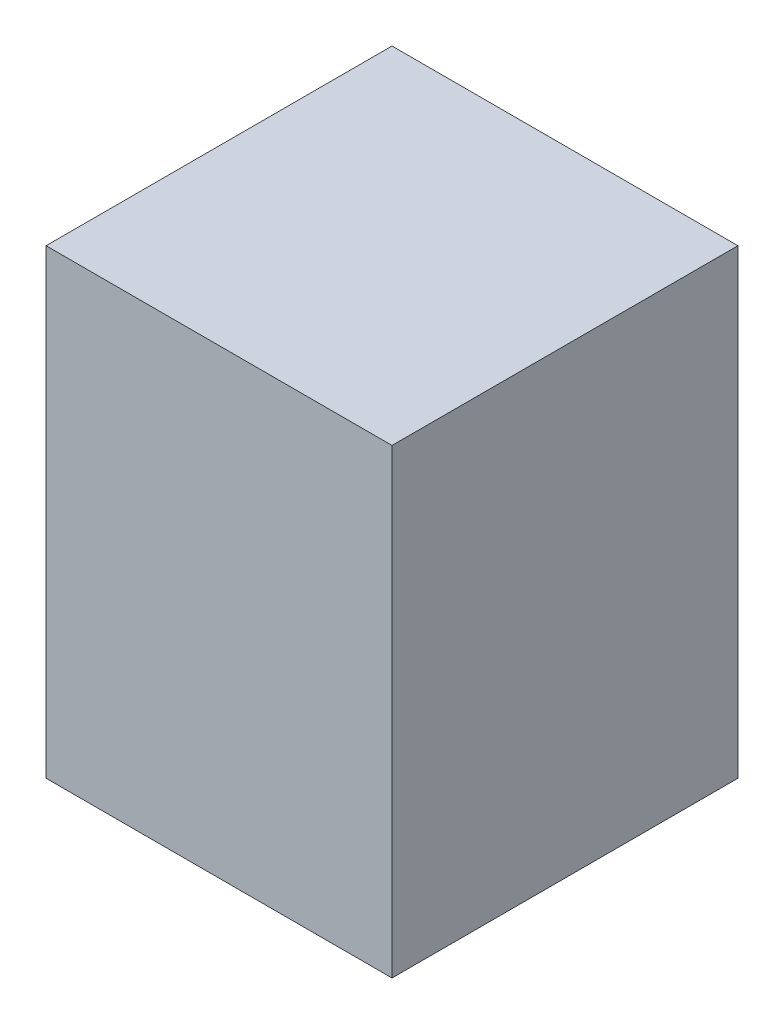
ISO-10303-21;
HEADER;
FILE_DESCRIPTION(('STEP AP214'),'2;1');
FILE_NAME('part.step','',(''),(''),'','','');
FILE_SCHEMA(('AUTOMOTIVE_DESIGN { 1 0 10303 214 1 1 1 1 }'));
ENDSEC;
DATA;
#1=APPLICATION_CONTEXT('core data for automotive mechanical design processes');
#2=APPLICATION_PROTOCOL_DEFINITION('international standard','automotive_design',2000,#1);
#3=PRODUCT_CONTEXT('',#1,'mechanical');
#4=PRODUCT('Part','Part','',(#3));
#5=PRODUCT_RELATED_PRODUCT_CATEGORY('part','',(#4));
#6=PRODUCT_DEFINITION_FORMATION('','',#4);
#7=PRODUCT_DEFINITION_CONTEXT('part definition',#1,'design');
#8=PRODUCT_DEFINITION('design','',#6,#7);
#9=PRODUCT_DEFINITION_SHAPE('','',#8);
#10=(LENGTH_UNIT() NAMED_UNIT(*) SI_UNIT(.MILLI.,.METRE.));
#11=(NAMED_UNIT(*) PLANE_ANGLE_UNIT() SI_UNIT($,.RADIAN.));
#12=(NAMED_UNIT(*) SI_UNIT($,.STERADIAN.) SOLID_ANGLE_UNIT());
#13=UNCERTAINTY_MEASURE_WITH_UNIT(LENGTH_MEASURE(1.E-05),#10,'distance_accuracy_value','');
#14=(GEOMETRIC_REPRESENTATION_CONTEXT(3) GLOBAL_UNCERTAINTY_ASSIGNED_CONTEXT((#13)) GLOBAL_UNIT_ASSIGNED_CONTEXT((#10,
#11,#12)) REPRESENTATION_CONTEXT('',''));
#15=CARTESIAN_POINT('',(0.,0.,0.));
#16=DIRECTION('',(0.,0.,1.));
#17=DIRECTION('',(1.,0.,0.));
#18=AXIS2_PLACEMENT_3D('',#15,#16,#17);
#19=CARTESIAN_POINT('',(15.,40.,-15.));
#20=DIRECTION('',(-1.,0.,0.));
#21=DIRECTION('',(0.,0.,1.));
#22=AXIS2_PLACEMENT_3D('',#19,#20,#21);
#23=PLANE('',#22);
#24=DIRECTION('',(0.,0.,-1.));
#25=VECTOR('',#24,1.);
#26=CARTESIAN_POINT('',(15.,0.,-15.));
#27=LINE('',#26,#25);
#28=CARTESIAN_POINT('',(15.,0.,15.));
#29=VERTEX_POINT('',#28);
#30=CARTESIAN_POINT('',(15.,0.,-15.));
#31=VERTEX_POINT('',#30);
#32=EDGE_CURVE('E101',#29,#31,#27,.T.);
#33=ORIENTED_EDGE('',*,*,#32,.T.);
#34=DIRECTION('',(0.,-1.,0.));
#35=VECTOR('',#34,1.);
#36=CARTESIAN_POINT('',(15.,40.,-15.));
#37=LINE('',#36,#35);
#38=CARTESIAN_POINT('',(15.,40.,-15.));
#39=VERTEX_POINT('',#38);
#40=EDGE_CURVE('E11',#39,#31,#37,.T.);
#41=ORIENTED_EDGE('',*,*,#40,.F.);
#42=DIRECTION('',(0.,0.,-1.));
#43=VECTOR('',#42,1.);
#44=CARTESIAN_POINT('',(15.,40.,-15.));
#45=LINE('',#44,#43);
#46=CARTESIAN_POINT('',(15.,40.,15.));
#47=VERTEX_POINT('',#46);
#48=EDGE_CURVE('E89',#47,#39,#45,.T.);
#49=ORIENTED_EDGE('',*,*,#48,.F.);
#50=DIRECTION('',(0.,-1.,0.));
#51=VECTOR('',#50,1.);
#52=CARTESIAN_POINT('',(15.,40.,15.));
#53=LINE('',#52,#51);
#54=EDGE_CURVE('E97',#47,#29,#53,.T.);
#55=ORIENTED_EDGE('',*,*,#54,.T.);
#56=EDGE_LOOP('',(#33,#41,#49,#55));
#57=FACE_BOUND('',#56,.T.);
#58=ADVANCED_FACE('F38',(#57),#23,.F.);
#59=CARTESIAN_POINT('',(-15.,40.,-15.));
#60=DIRECTION('',(0.,0.,1.));
#61=DIRECTION('',(1.,0.,0.));
#62=AXIS2_PLACEMENT_3D('',#59,#60,#61);
#63=PLANE('',#62);
#64=DIRECTION('',(-1.,0.,0.));
#65=VECTOR('',#64,1.);
#66=CARTESIAN_POINT('',(-15.,0.,-15.));
#67=LINE('',#66,#65);
#68=CARTESIAN_POINT('',(-15.,0.,-15.));
#69=VERTEX_POINT('',#68);
#70=EDGE_CURVE('E93',#31,#69,#67,.T.);
#71=ORIENTED_EDGE('',*,*,#70,.T.);
#72=DIRECTION('',(0.,-1.,0.));
#73=VECTOR('',#72,1.);
#74=CARTESIAN_POINT('',(-15.,40.,-15.));
#75=LINE('',#74,#73);
#76=CARTESIAN_POINT('',(-15.,40.,-15.));
#77=VERTEX_POINT('',#76);
#78=EDGE_CURVE('E46',#77,#69,#75,.T.);
#79=ORIENTED_EDGE('',*,*,#78,.F.);
#80=DIRECTION('',(-1.,0.,0.));
#81=VECTOR('',#80,1.);
#82=CARTESIAN_POINT('',(-15.,40.,-15.));
#83=LINE('',#82,#81);
#84=EDGE_CURVE('E84',#39,#77,#83,.T.);
#85=ORIENTED_EDGE('',*,*,#84,.F.);
#86=ORIENTED_EDGE('',*,*,#40,.T.);
#87=EDGE_LOOP('',(#71,#79,#85,#86));
#88=FACE_BOUND('',#87,.T.);
#89=ADVANCED_FACE('F92',(#88),#63,.F.);
#90=CARTESIAN_POINT('',(-15.,40.,-15.));
#91=DIRECTION('',(1.,0.,0.));
#92=DIRECTION('',(0.,0.,-1.));
#93=AXIS2_PLACEMENT_3D('',#90,#91,#92);
#94=PLANE('',#93);
#95=DIRECTION('',(0.,0.,1.));
#96=VECTOR('',#95,1.);
#97=CARTESIAN_POINT('',(-15.,0.,-15.));
#98=LINE('',#97,#96);
#99=CARTESIAN_POINT('',(-15.,0.,15.));
#100=VERTEX_POINT('',#99);
#101=EDGE_CURVE('E71',#69,#100,#98,.T.);
#102=ORIENTED_EDGE('',*,*,#101,.T.);
#103=DIRECTION('',(0.,-1.,0.));
#104=VECTOR('',#103,1.);
#105=CARTESIAN_POINT('',(-15.,40.,15.));
#106=LINE('',#105,#104);
#107=CARTESIAN_POINT('',(-15.,40.,15.));
#108=VERTEX_POINT('',#107);
#109=EDGE_CURVE('E94',#108,#100,#106,.T.);
#110=ORIENTED_EDGE('',*,*,#109,.F.);
#111=DIRECTION('',(0.,0.,1.));
#112=VECTOR('',#111,1.);
#113=CARTESIAN_POINT('',(-15.,40.,-15.));
#114=LINE('',#113,#112);
#115=EDGE_CURVE('E87',#77,#108,#114,.T.);
#116=ORIENTED_EDGE('',*,*,#115,.F.);
#117=ORIENTED_EDGE('',*,*,#78,.T.);
#118=EDGE_LOOP('',(#102,#110,#116,#117));
#119=FACE_BOUND('',#118,.T.);
#120=ADVANCED_FACE('F95',(#119),#94,.F.);
#121=CARTESIAN_POINT('',(-15.,40.,15.));
#122=DIRECTION('',(0.,0.,-1.));
#123=DIRECTION('',(-1.,0.,0.));
#124=AXIS2_PLACEMENT_3D('',#121,#122,#123);
#125=PLANE('',#124);
#126=DIRECTION('',(1.,0.,0.));
#127=VECTOR('',#126,1.);
#128=CARTESIAN_POINT('',(-15.,0.,15.));
#129=LINE('',#128,#127);
#130=EDGE_CURVE('E77',#100,#29,#129,.T.);
#131=ORIENTED_EDGE('',*,*,#130,.T.);
#132=ORIENTED_EDGE('',*,*,#54,.F.);
#133=DIRECTION('',(1.,0.,0.));
#134=VECTOR('',#133,1.);
#135=CARTESIAN_POINT('',(-15.,40.,15.));
#136=LINE('',#135,#134);
#137=EDGE_CURVE('E54',#108,#47,#136,.T.);
#138=ORIENTED_EDGE('',*,*,#137,.F.);
#139=ORIENTED_EDGE('',*,*,#109,.T.);
#140=EDGE_LOOP('',(#131,#132,#138,#139));
#141=FACE_BOUND('',#140,.T.);
#142=ADVANCED_FACE('F108',(#141),#125,.F.);
#143=CARTESIAN_POINT('',(0.,40.,0.));
#144=DIRECTION('',(0.,1.,0.));
#145=DIRECTION('',(0.,0.,1.));
#146=AXIS2_PLACEMENT_3D('',#143,#144,#145);
#147=PLANE('',#146);
#148=ORIENTED_EDGE('',*,*,#48,.T.);
#149=ORIENTED_EDGE('',*,*,#84,.T.);
#150=ORIENTED_EDGE('',*,*,#115,.T.);
#151=ORIENTED_EDGE('',*,*,#137,.T.);
#152=EDGE_LOOP('',(#148,#149,#150,#151));
#153=FACE_BOUND('',#152,.T.);
#154=ADVANCED_FACE('F85',(#153),#147,.T.);
#155=CARTESIAN_POINT('',(0.,0.,0.));
#156=DIRECTION('',(0.,1.,0.));
#157=DIRECTION('',(0.,0.,1.));
#158=AXIS2_PLACEMENT_3D('',#155,#156,#157);
#159=PLANE('',#158);
#160=ORIENTED_EDGE('',*,*,#32,.F.);
#161=ORIENTED_EDGE('',*,*,#130,.F.);
#162=ORIENTED_EDGE('',*,*,#101,.F.);
#163=ORIENTED_EDGE('',*,*,#70,.F.);
#164=EDGE_LOOP('',(#160,#161,#162,#163));
#165=FACE_BOUND('',#164,.T.);
#166=ADVANCED_FACE('F111',(#165),#159,.F.);
#167=CLOSED_SHELL('',(#58,#89,#120,#142,#154,#166));
#168=MANIFOLD_SOLID_BREP('B2',#167);
#169=ADVANCED_BREP_SHAPE_REPRESENTATION('',(#18,#168),#14);
#170=SHAPE_DEFINITION_REPRESENTATION(#9,#169);
ENDSEC;
END-ISO-10303-21;
